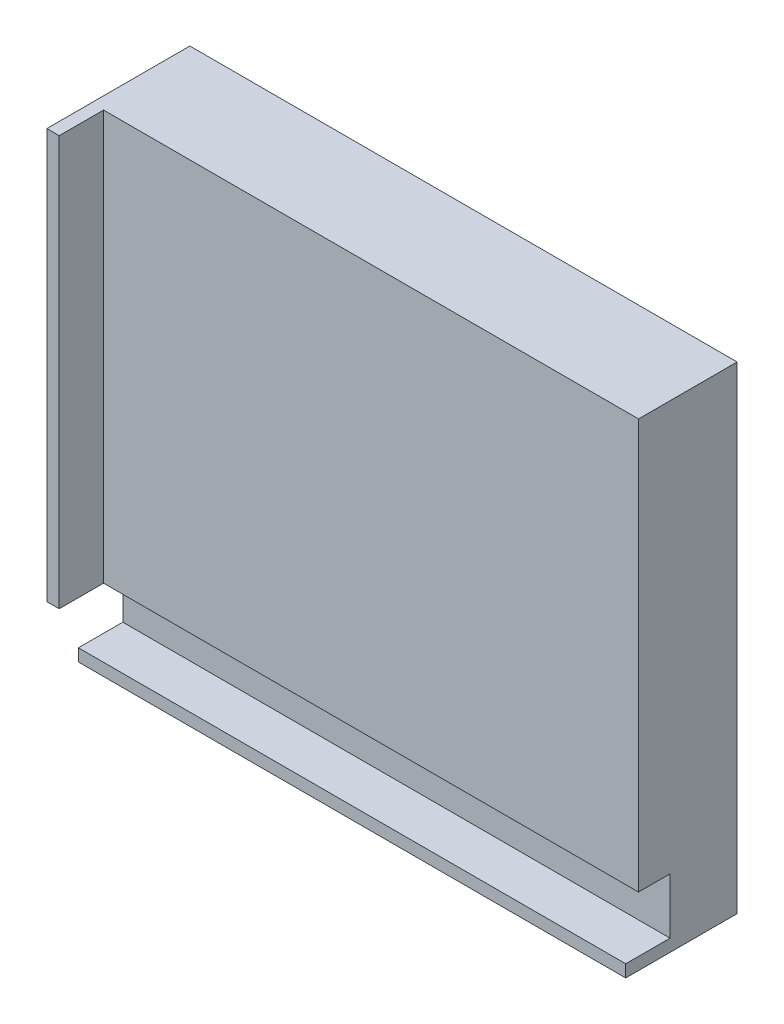
ISO-10303-21;
HEADER;
FILE_DESCRIPTION(('STEP AP214'),'2;1');
FILE_NAME('part.step','',(''),(''),'','','');
FILE_SCHEMA(('AUTOMOTIVE_DESIGN { 1 0 10303 214 1 1 1 1 }'));
ENDSEC;
DATA;
#1=APPLICATION_CONTEXT('core data for automotive mechanical design processes');
#2=APPLICATION_PROTOCOL_DEFINITION('international standard','automotive_design',2000,#1);
#3=PRODUCT_CONTEXT('',#1,'mechanical');
#4=PRODUCT('Part','Part','',(#3));
#5=PRODUCT_RELATED_PRODUCT_CATEGORY('part','',(#4));
#6=PRODUCT_DEFINITION_FORMATION('','',#4);
#7=PRODUCT_DEFINITION_CONTEXT('part definition',#1,'design');
#8=PRODUCT_DEFINITION('design','',#6,#7);
#9=PRODUCT_DEFINITION_SHAPE('','',#8);
#10=(LENGTH_UNIT() NAMED_UNIT(*) SI_UNIT(.MILLI.,.METRE.));
#11=(NAMED_UNIT(*) PLANE_ANGLE_UNIT() SI_UNIT($,.RADIAN.));
#12=(NAMED_UNIT(*) SI_UNIT($,.STERADIAN.) SOLID_ANGLE_UNIT());
#13=UNCERTAINTY_MEASURE_WITH_UNIT(LENGTH_MEASURE(1.E-05),#10,'distance_accuracy_value','');
#14=(GEOMETRIC_REPRESENTATION_CONTEXT(3) GLOBAL_UNCERTAINTY_ASSIGNED_CONTEXT((#13)) GLOBAL_UNIT_ASSIGNED_CONTEXT((#10,
#11,#12)) REPRESENTATION_CONTEXT('',''));
#15=CARTESIAN_POINT('',(0.,0.,0.));
#16=DIRECTION('',(0.,0.,1.));
#17=DIRECTION('',(1.,0.,0.));
#18=AXIS2_PLACEMENT_3D('',#15,#16,#17);
#19=CARTESIAN_POINT('',(72.6168292682927,25.1026341463416,36.83));
#20=DIRECTION('',(0.,1.,0.));
#21=DIRECTION('',(0.,0.,1.));
#22=AXIS2_PLACEMENT_3D('',#19,#20,#21);
#23=PLANE('',#22);
#24=DIRECTION('',(-1.,0.,0.));
#25=VECTOR('',#24,1.);
#26=CARTESIAN_POINT('',(0.,25.1026341463416,25.4));
#27=LINE('',#26,#25);
#28=CARTESIAN_POINT('',(72.6068292682926,25.1026341463416,25.4));
#29=VERTEX_POINT('',#28);
#30=CARTESIAN_POINT('',(-65.1881707317074,25.1026341463416,25.4));
#31=VERTEX_POINT('',#30);
#32=EDGE_CURVE('E131',#29,#31,#27,.T.);
#33=ORIENTED_EDGE('',*,*,#32,.F.);
#34=DIRECTION('',(0.,0.,-1.));
#35=VECTOR('',#34,1.);
#36=CARTESIAN_POINT('',(72.6068292682926,25.1026341463416,36.84));
#37=LINE('',#36,#35);
#38=CARTESIAN_POINT('',(72.6068292682926,25.1026341463416,0.));
#39=VERTEX_POINT('',#38);
#40=EDGE_CURVE('E115',#29,#39,#37,.T.);
#41=ORIENTED_EDGE('',*,*,#40,.T.);
#42=DIRECTION('',(-1.,0.,0.));
#43=VECTOR('',#42,1.);
#44=CARTESIAN_POINT('',(0.,25.1026341463416,0.));
#45=LINE('',#44,#43);
#46=CARTESIAN_POINT('',(-68.3631707317074,25.1026341463416,0.));
#47=VERTEX_POINT('',#46);
#48=EDGE_CURVE('E129',#39,#47,#45,.T.);
#49=ORIENTED_EDGE('',*,*,#48,.T.);
#50=DIRECTION('',(0.,0.,-1.));
#51=VECTOR('',#50,1.);
#52=CARTESIAN_POINT('',(-68.3631707317073,25.1026341463416,17.272));
#53=LINE('',#52,#51);
#54=CARTESIAN_POINT('',(-68.3631707317074,25.1026341463416,36.83));
#55=VERTEX_POINT('',#54);
#56=EDGE_CURVE('E132',#55,#47,#53,.T.);
#57=ORIENTED_EDGE('',*,*,#56,.F.);
#58=DIRECTION('',(-1.,0.,0.));
#59=VECTOR('',#58,1.);
#60=CARTESIAN_POINT('',(213.576829268293,25.1026341463416,36.83));
#61=LINE('',#60,#59);
#62=CARTESIAN_POINT('',(-65.1881707317074,25.1026341463416,36.83));
#63=VERTEX_POINT('',#62);
#64=EDGE_CURVE('E162',#63,#55,#61,.T.);
#65=ORIENTED_EDGE('',*,*,#64,.F.);
#66=DIRECTION('',(0.,0.,1.));
#67=VECTOR('',#66,1.);
#68=CARTESIAN_POINT('',(-65.1881707317074,25.1026341463416,0.));
#69=LINE('',#68,#67);
#70=EDGE_CURVE('E142',#31,#63,#69,.T.);
#71=ORIENTED_EDGE('',*,*,#70,.F.);
#72=EDGE_LOOP('',(#33,#41,#49,#57,#65,#71));
#73=FACE_BOUND('',#72,.T.);
#74=ADVANCED_FACE('F38',(#73),#23,.T.);
#75=CARTESIAN_POINT('',(0.,0.,17.272));
#76=DIRECTION('',(0.,0.,-1.));
#77=DIRECTION('',(-1.,0.,0.));
#78=AXIS2_PLACEMENT_3D('',#75,#76,#77);
#79=PLANE('',#78);
#80=DIRECTION('',(1.,0.,0.));
#81=VECTOR('',#80,1.);
#82=CARTESIAN_POINT('',(213.576829268293,-94.7853658536585,17.272));
#83=LINE('',#82,#81);
#84=CARTESIAN_POINT('',(-68.3631707317073,-94.7853658536585,17.272));
#85=VERTEX_POINT('',#84);
#86=CARTESIAN_POINT('',(72.6068292682926,-94.7853658536585,17.272));
#87=VERTEX_POINT('',#86);
#88=EDGE_CURVE('E224',#85,#87,#83,.T.);
#89=ORIENTED_EDGE('',*,*,#88,.T.);
#90=DIRECTION('',(0.,1.,0.));
#91=VECTOR('',#90,1.);
#92=CARTESIAN_POINT('',(72.6068292682926,0.,17.272));
#93=LINE('',#92,#91);
#94=CARTESIAN_POINT('',(72.6068292682926,-80.4343658536585,17.272));
#95=VERTEX_POINT('',#94);
#96=EDGE_CURVE('E124',#87,#95,#93,.T.);
#97=ORIENTED_EDGE('',*,*,#96,.T.);
#98=DIRECTION('',(-1.,0.,0.));
#99=VECTOR('',#98,1.);
#100=CARTESIAN_POINT('',(-68.3631707317074,-80.4343658536585,17.272));
#101=LINE('',#100,#99);
#102=CARTESIAN_POINT('',(-68.3631707317074,-80.4343658536585,17.272));
#103=VERTEX_POINT('',#102);
#104=EDGE_CURVE('E213',#95,#103,#101,.T.);
#105=ORIENTED_EDGE('',*,*,#104,.T.);
#106=DIRECTION('',(0.,-1.,0.));
#107=VECTOR('',#106,1.);
#108=CARTESIAN_POINT('',(-68.3631707317073,-97.9603658536585,17.272));
#109=LINE('',#108,#107);
#110=EDGE_CURVE('E217',#103,#85,#109,.T.);
#111=ORIENTED_EDGE('',*,*,#110,.T.);
#112=EDGE_LOOP('',(#89,#97,#105,#111));
#113=FACE_BOUND('',#112,.T.);
#114=ADVANCED_FACE('F183',(#113),#79,.F.);
#115=CARTESIAN_POINT('',(0.,-94.7853658536585,0.));
#116=DIRECTION('',(0.,1.,0.));
#117=DIRECTION('',(0.,0.,1.));
#118=AXIS2_PLACEMENT_3D('',#115,#116,#117);
#119=PLANE('',#118);
#120=DIRECTION('',(0.,0.,1.));
#121=VECTOR('',#120,1.);
#122=CARTESIAN_POINT('',(72.6068292682926,-94.7853658536585,0.));
#123=LINE('',#122,#121);
#124=CARTESIAN_POINT('',(72.6068292682926,-94.7853658536585,28.702));
#125=VERTEX_POINT('',#124);
#126=EDGE_CURVE('E141',#87,#125,#123,.T.);
#127=ORIENTED_EDGE('',*,*,#126,.F.);
#128=ORIENTED_EDGE('',*,*,#88,.F.);
#129=DIRECTION('',(0.,0.,-1.));
#130=VECTOR('',#129,1.);
#131=CARTESIAN_POINT('',(-68.3631707317073,-94.7853658536585,17.272));
#132=LINE('',#131,#130);
#133=CARTESIAN_POINT('',(-68.3631707317073,-94.7853658536585,28.702));
#134=VERTEX_POINT('',#133);
#135=EDGE_CURVE('E229',#134,#85,#132,.T.);
#136=ORIENTED_EDGE('',*,*,#135,.F.);
#137=DIRECTION('',(-1.,0.,0.));
#138=VECTOR('',#137,1.);
#139=CARTESIAN_POINT('',(-68.3631707317073,-94.7853658536585,28.702));
#140=LINE('',#139,#138);
#141=EDGE_CURVE('E227',#125,#134,#140,.T.);
#142=ORIENTED_EDGE('',*,*,#141,.F.);
#143=EDGE_LOOP('',(#127,#128,#136,#142));
#144=FACE_BOUND('',#143,.T.);
#145=ADVANCED_FACE('F185',(#144),#119,.T.);
#146=CARTESIAN_POINT('',(-68.3631707317073,-94.7853658536585,28.702));
#147=DIRECTION('',(0.,0.,1.));
#148=DIRECTION('',(1.,0.,0.));
#149=AXIS2_PLACEMENT_3D('',#146,#147,#148);
#150=PLANE('',#149);
#151=DIRECTION('',(0.,-1.,0.));
#152=VECTOR('',#151,1.);
#153=CARTESIAN_POINT('',(72.6068292682926,-94.7853658536585,28.702));
#154=LINE('',#153,#152);
#155=CARTESIAN_POINT('',(72.6068292682926,-97.9603658536585,28.702));
#156=VERTEX_POINT('',#155);
#157=EDGE_CURVE('E238',#125,#156,#154,.T.);
#158=ORIENTED_EDGE('',*,*,#157,.F.);
#159=ORIENTED_EDGE('',*,*,#141,.T.);
#160=DIRECTION('',(0.,-1.,0.));
#161=VECTOR('',#160,1.);
#162=CARTESIAN_POINT('',(-68.3631707317073,-94.7853658536585,28.702));
#163=LINE('',#162,#161);
#164=CARTESIAN_POINT('',(-68.3631707317073,-97.9603658536585,28.702));
#165=VERTEX_POINT('',#164);
#166=EDGE_CURVE('E232',#134,#165,#163,.T.);
#167=ORIENTED_EDGE('',*,*,#166,.T.);
#168=DIRECTION('',(-1.,0.,0.));
#169=VECTOR('',#168,1.);
#170=CARTESIAN_POINT('',(-68.3631707317073,-97.9603658536585,28.702));
#171=LINE('',#170,#169);
#172=EDGE_CURVE('E223',#156,#165,#171,.T.);
#173=ORIENTED_EDGE('',*,*,#172,.F.);
#174=EDGE_LOOP('',(#158,#159,#167,#173));
#175=FACE_BOUND('',#174,.T.);
#176=ADVANCED_FACE('F192',(#175),#150,.T.);
#177=CARTESIAN_POINT('',(-68.3631707317073,-94.7853658536585,17.272));
#178=DIRECTION('',(-1.,0.,0.));
#179=DIRECTION('',(0.,0.,1.));
#180=AXIS2_PLACEMENT_3D('',#177,#178,#179);
#181=PLANE('',#180);
#182=DIRECTION('',(0.,1.,0.));
#183=VECTOR('',#182,1.);
#184=CARTESIAN_POINT('',(-68.3631707317074,130.639634146342,36.83));
#185=LINE('',#184,#183);
#186=CARTESIAN_POINT('',(-68.3631707317073,-80.4343658536585,36.83));
#187=VERTEX_POINT('',#186);
#188=EDGE_CURVE('E11',#187,#55,#185,.T.);
#189=ORIENTED_EDGE('',*,*,#188,.T.);
#190=ORIENTED_EDGE('',*,*,#56,.T.);
#191=DIRECTION('',(0.,-1.,0.));
#192=VECTOR('',#191,1.);
#193=CARTESIAN_POINT('',(-68.3631707317074,130.639634146342,0.));
#194=LINE('',#193,#192);
#195=CARTESIAN_POINT('',(-68.3631707317073,-97.9603658536585,0.));
#196=VERTEX_POINT('',#195);
#197=EDGE_CURVE('E135',#47,#196,#194,.T.);
#198=ORIENTED_EDGE('',*,*,#197,.T.);
#199=DIRECTION('',(0.,0.,-1.));
#200=VECTOR('',#199,1.);
#201=CARTESIAN_POINT('',(-68.3631707317073,-97.9603658536585,17.272));
#202=LINE('',#201,#200);
#203=EDGE_CURVE('E226',#165,#196,#202,.T.);
#204=ORIENTED_EDGE('',*,*,#203,.F.);
#205=ORIENTED_EDGE('',*,*,#166,.F.);
#206=ORIENTED_EDGE('',*,*,#135,.T.);
#207=ORIENTED_EDGE('',*,*,#110,.F.);
#208=DIRECTION('',(0.,0.,1.));
#209=VECTOR('',#208,1.);
#210=CARTESIAN_POINT('',(-68.3631707317074,-80.4343658536585,17.272));
#211=LINE('',#210,#209);
#212=EDGE_CURVE('E52',#103,#187,#211,.T.);
#213=ORIENTED_EDGE('',*,*,#212,.T.);
#214=EDGE_LOOP('',(#189,#190,#198,#204,#205,#206,#207,#213));
#215=FACE_BOUND('',#214,.T.);
#216=ADVANCED_FACE('F164',(#215),#181,.T.);
#217=CARTESIAN_POINT('',(-68.3631707317074,-80.4343658536585,17.272));
#218=DIRECTION('',(0.,1.,0.));
#219=DIRECTION('',(0.,0.,1.));
#220=AXIS2_PLACEMENT_3D('',#217,#218,#219);
#221=PLANE('',#220);
#222=ORIENTED_EDGE('',*,*,#104,.F.);
#223=DIRECTION('',(0.,0.,1.));
#224=VECTOR('',#223,1.);
#225=CARTESIAN_POINT('',(72.6068292682926,-80.4343658536585,17.272));
#226=LINE('',#225,#224);
#227=CARTESIAN_POINT('',(72.6068292682926,-80.4343658536585,25.4));
#228=VERTEX_POINT('',#227);
#229=EDGE_CURVE('E123',#95,#228,#226,.T.);
#230=ORIENTED_EDGE('',*,*,#229,.T.);
#231=DIRECTION('',(-1.,0.,0.));
#232=VECTOR('',#231,1.);
#233=CARTESIAN_POINT('',(-68.3631707317074,-80.4343658536585,25.4));
#234=LINE('',#233,#232);
#235=CARTESIAN_POINT('',(-65.1881707317073,-80.4343658536585,25.4));
#236=VERTEX_POINT('',#235);
#237=EDGE_CURVE('E216',#228,#236,#234,.T.);
#238=ORIENTED_EDGE('',*,*,#237,.T.);
#239=DIRECTION('',(0.,0.,1.));
#240=VECTOR('',#239,1.);
#241=CARTESIAN_POINT('',(-65.1881707317073,-80.4343658536585,36.83));
#242=LINE('',#241,#240);
#243=CARTESIAN_POINT('',(-65.1881707317073,-80.4343658536585,36.83));
#244=VERTEX_POINT('',#243);
#245=EDGE_CURVE('E148',#236,#244,#242,.T.);
#246=ORIENTED_EDGE('',*,*,#245,.T.);
#247=DIRECTION('',(-1.,0.,0.));
#248=VECTOR('',#247,1.);
#249=CARTESIAN_POINT('',(-65.1881707317073,-80.4343658536585,36.83));
#250=LINE('',#249,#248);
#251=EDGE_CURVE('E149',#244,#187,#250,.T.);
#252=ORIENTED_EDGE('',*,*,#251,.T.);
#253=ORIENTED_EDGE('',*,*,#212,.F.);
#254=EDGE_LOOP('',(#222,#230,#238,#246,#252,#253));
#255=FACE_BOUND('',#254,.T.);
#256=ADVANCED_FACE('F198',(#255),#221,.F.);
#257=CARTESIAN_POINT('',(213.576829268293,127.464634146342,36.83));
#258=DIRECTION('',(0.,0.,1.));
#259=DIRECTION('',(1.,0.,0.));
#260=AXIS2_PLACEMENT_3D('',#257,#258,#259);
#261=PLANE('',#260);
#262=DIRECTION('',(0.,1.,0.));
#263=VECTOR('',#262,1.);
#264=CARTESIAN_POINT('',(-65.1881707317074,130.639634146342,36.83));
#265=LINE('',#264,#263);
#266=EDGE_CURVE('E146',#244,#63,#265,.T.);
#267=ORIENTED_EDGE('',*,*,#266,.T.);
#268=ORIENTED_EDGE('',*,*,#64,.T.);
#269=ORIENTED_EDGE('',*,*,#188,.F.);
#270=ORIENTED_EDGE('',*,*,#251,.F.);
#271=EDGE_LOOP('',(#267,#268,#269,#270));
#272=FACE_BOUND('',#271,.T.);
#273=ADVANCED_FACE('F171',(#272),#261,.T.);
#274=CARTESIAN_POINT('',(0.,0.,25.4));
#275=DIRECTION('',(0.,0.,1.));
#276=DIRECTION('',(1.,0.,0.));
#277=AXIS2_PLACEMENT_3D('',#274,#275,#276);
#278=PLANE('',#277);
#279=DIRECTION('',(0.,-1.,0.));
#280=VECTOR('',#279,1.);
#281=CARTESIAN_POINT('',(72.6068292682926,0.,25.4));
#282=LINE('',#281,#280);
#283=EDGE_CURVE('E140',#29,#228,#282,.T.);
#284=ORIENTED_EDGE('',*,*,#283,.F.);
#285=ORIENTED_EDGE('',*,*,#32,.T.);
#286=DIRECTION('',(0.,-1.,0.));
#287=VECTOR('',#286,1.);
#288=CARTESIAN_POINT('',(-65.1881707317073,-80.4343658536585,25.4));
#289=LINE('',#288,#287);
#290=EDGE_CURVE('E47',#31,#236,#289,.T.);
#291=ORIENTED_EDGE('',*,*,#290,.T.);
#292=ORIENTED_EDGE('',*,*,#237,.F.);
#293=EDGE_LOOP('',(#284,#285,#291,#292));
#294=FACE_BOUND('',#293,.T.);
#295=ADVANCED_FACE('F175',(#294),#278,.T.);
#296=CARTESIAN_POINT('',(-65.1881707317074,0.,0.));
#297=DIRECTION('',(1.,0.,0.));
#298=DIRECTION('',(0.,1.,0.));
#299=AXIS2_PLACEMENT_3D('',#296,#297,#298);
#300=PLANE('',#299);
#301=ORIENTED_EDGE('',*,*,#290,.F.);
#302=ORIENTED_EDGE('',*,*,#70,.T.);
#303=ORIENTED_EDGE('',*,*,#266,.F.);
#304=ORIENTED_EDGE('',*,*,#245,.F.);
#305=EDGE_LOOP('',(#301,#302,#303,#304));
#306=FACE_BOUND('',#305,.T.);
#307=ADVANCED_FACE('F40',(#306),#300,.T.);
#308=CARTESIAN_POINT('',(0.,-97.9603658536585,0.));
#309=DIRECTION('',(0.,1.,0.));
#310=DIRECTION('',(0.,0.,1.));
#311=AXIS2_PLACEMENT_3D('',#308,#309,#310);
#312=PLANE('',#311);
#313=DIRECTION('',(1.,0.,0.));
#314=VECTOR('',#313,1.);
#315=CARTESIAN_POINT('',(-68.3631707317073,-97.9603658536585,0.));
#316=LINE('',#315,#314);
#317=CARTESIAN_POINT('',(72.6068292682926,-97.9603658536585,0.));
#318=VERTEX_POINT('',#317);
#319=EDGE_CURVE('E145',#196,#318,#316,.T.);
#320=ORIENTED_EDGE('',*,*,#319,.T.);
#321=DIRECTION('',(0.,0.,1.));
#322=VECTOR('',#321,1.);
#323=CARTESIAN_POINT('',(72.6068292682926,-97.9603658536585,0.));
#324=LINE('',#323,#322);
#325=EDGE_CURVE('E118',#318,#156,#324,.T.);
#326=ORIENTED_EDGE('',*,*,#325,.T.);
#327=ORIENTED_EDGE('',*,*,#172,.T.);
#328=ORIENTED_EDGE('',*,*,#203,.T.);
#329=EDGE_LOOP('',(#320,#326,#327,#328));
#330=FACE_BOUND('',#329,.T.);
#331=ADVANCED_FACE('F174',(#330),#312,.F.);
#332=CARTESIAN_POINT('',(72.6068292682926,-97.9603658536585,36.84));
#333=DIRECTION('',(-1.,0.,0.));
#334=DIRECTION('',(0.,-1.,0.));
#335=AXIS2_PLACEMENT_3D('',#332,#333,#334);
#336=PLANE('',#335);
#337=ORIENTED_EDGE('',*,*,#40,.F.);
#338=ORIENTED_EDGE('',*,*,#283,.T.);
#339=ORIENTED_EDGE('',*,*,#229,.F.);
#340=ORIENTED_EDGE('',*,*,#96,.F.);
#341=ORIENTED_EDGE('',*,*,#126,.T.);
#342=ORIENTED_EDGE('',*,*,#157,.T.);
#343=ORIENTED_EDGE('',*,*,#325,.F.);
#344=DIRECTION('',(0.,-1.,0.));
#345=VECTOR('',#344,1.);
#346=CARTESIAN_POINT('',(72.6068292682926,0.,0.));
#347=LINE('',#346,#345);
#348=EDGE_CURVE('E112',#39,#318,#347,.T.);
#349=ORIENTED_EDGE('',*,*,#348,.F.);
#350=EDGE_LOOP('',(#337,#338,#339,#340,#341,#342,#343,#349));
#351=FACE_BOUND('',#350,.T.);
#352=ADVANCED_FACE('F114',(#351),#336,.F.);
#353=CARTESIAN_POINT('',(0.,0.,0.));
#354=DIRECTION('',(0.,0.,1.));
#355=DIRECTION('',(1.,0.,0.));
#356=AXIS2_PLACEMENT_3D('',#353,#354,#355);
#357=PLANE('',#356);
#358=ORIENTED_EDGE('',*,*,#48,.F.);
#359=ORIENTED_EDGE('',*,*,#348,.T.);
#360=ORIENTED_EDGE('',*,*,#319,.F.);
#361=ORIENTED_EDGE('',*,*,#197,.F.);
#362=EDGE_LOOP('',(#358,#359,#360,#361));
#363=FACE_BOUND('',#362,.T.);
#364=ADVANCED_FACE('F134',(#363),#357,.F.);
#365=CLOSED_SHELL('',(#74,#114,#145,#176,#216,#256,#273,#295,#307,#331,#352,#364));
#366=MANIFOLD_SOLID_BREP('B2',#365);
#367=ADVANCED_BREP_SHAPE_REPRESENTATION('',(#18,#366),#14);
#368=SHAPE_DEFINITION_REPRESENTATION(#9,#367);
ENDSEC;
END-ISO-10303-21;
